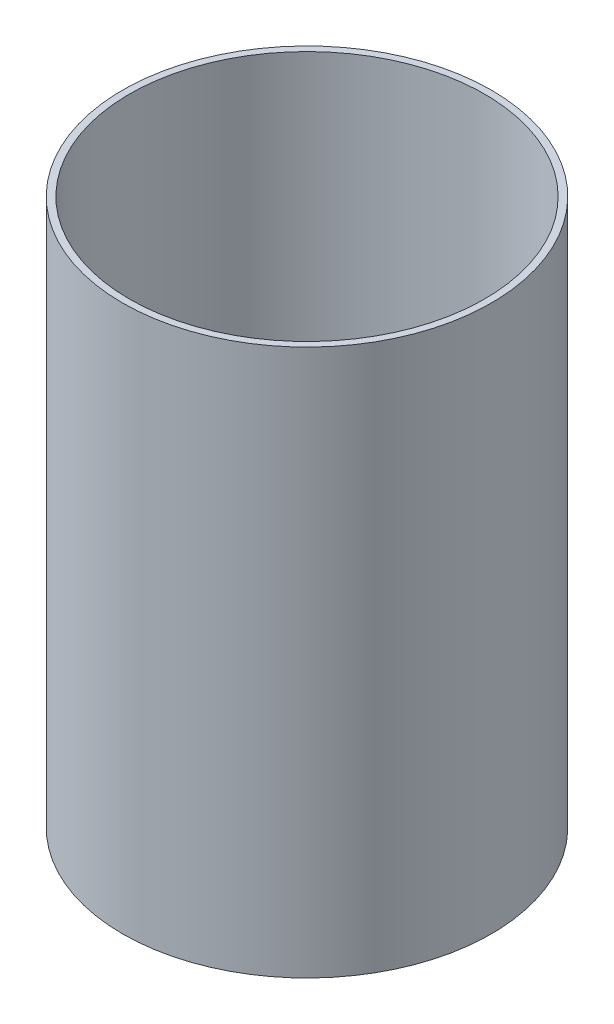
ISO-10303-21;
HEADER;
FILE_DESCRIPTION(('STEP AP214'),'2;1');
FILE_NAME('part.step','',(''),(''),'','','');
FILE_SCHEMA(('AUTOMOTIVE_DESIGN { 1 0 10303 214 1 1 1 1 }'));
ENDSEC;
DATA;
#1=APPLICATION_CONTEXT('core data for automotive mechanical design processes');
#2=APPLICATION_PROTOCOL_DEFINITION('international standard','automotive_design',2000,#1);
#3=PRODUCT_CONTEXT('',#1,'mechanical');
#4=PRODUCT('Part','Part','',(#3));
#5=PRODUCT_RELATED_PRODUCT_CATEGORY('part','',(#4));
#6=PRODUCT_DEFINITION_FORMATION('','',#4);
#7=PRODUCT_DEFINITION_CONTEXT('part definition',#1,'design');
#8=PRODUCT_DEFINITION('design','',#6,#7);
#9=PRODUCT_DEFINITION_SHAPE('','',#8);
#10=(LENGTH_UNIT() NAMED_UNIT(*) SI_UNIT(.MILLI.,.METRE.));
#11=(NAMED_UNIT(*) PLANE_ANGLE_UNIT() SI_UNIT($,.RADIAN.));
#12=(NAMED_UNIT(*) SI_UNIT($,.STERADIAN.) SOLID_ANGLE_UNIT());
#13=UNCERTAINTY_MEASURE_WITH_UNIT(LENGTH_MEASURE(1.E-05),#10,'distance_accuracy_value','');
#14=(GEOMETRIC_REPRESENTATION_CONTEXT(3) GLOBAL_UNCERTAINTY_ASSIGNED_CONTEXT((#13)) GLOBAL_UNIT_ASSIGNED_CONTEXT((#10,
#11,#12)) REPRESENTATION_CONTEXT('',''));
#15=CARTESIAN_POINT('',(0.,0.,0.));
#16=DIRECTION('',(0.,0.,1.));
#17=DIRECTION('',(1.,0.,0.));
#18=AXIS2_PLACEMENT_3D('',#15,#16,#17);
#19=CARTESIAN_POINT('',(0.,203.2,0.));
#20=DIRECTION('',(0.,1.,0.));
#21=DIRECTION('',(0.,0.,1.));
#22=AXIS2_PLACEMENT_3D('',#19,#20,#21);
#23=PLANE('',#22);
#24=CARTESIAN_POINT('',(0.,203.2,0.));
#25=DIRECTION('',(0.,1.,0.));
#26=DIRECTION('',(0.,0.,1.));
#27=AXIS2_PLACEMENT_3D('',#24,#25,#26);
#28=CIRCLE('',#27,68.58);
#29=CARTESIAN_POINT('',(0.,203.2,68.58));
#30=VERTEX_POINT('',#29);
#31=EDGE_CURVE('E10',#30,#30,#28,.T.);
#32=ORIENTED_EDGE('',*,*,#31,.T.);
#33=EDGE_LOOP('',(#32));
#34=FACE_BOUND('',#33,.T.);
#35=CARTESIAN_POINT('',(0.,203.2,0.));
#36=DIRECTION('',(0.,1.,0.));
#37=DIRECTION('',(0.,0.,1.));
#38=AXIS2_PLACEMENT_3D('',#35,#36,#37);
#39=CIRCLE('',#38,66.04);
#40=CARTESIAN_POINT('',(0.,203.2,66.04));
#41=VERTEX_POINT('',#40);
#42=EDGE_CURVE('E47',#41,#41,#39,.T.);
#43=ORIENTED_EDGE('',*,*,#42,.F.);
#44=EDGE_LOOP('',(#43));
#45=FACE_BOUND('',#44,.T.);
#46=ADVANCED_FACE('F35',(#34,#45),#23,.T.);
#47=CARTESIAN_POINT('',(0.,0.,0.));
#48=DIRECTION('',(0.,1.,0.));
#49=DIRECTION('',(0.,0.,1.));
#50=AXIS2_PLACEMENT_3D('',#47,#48,#49);
#51=PLANE('',#50);
#52=CARTESIAN_POINT('',(0.,0.,0.));
#53=DIRECTION('',(0.,1.,0.));
#54=DIRECTION('',(0.,0.,1.));
#55=AXIS2_PLACEMENT_3D('',#52,#53,#54);
#56=CIRCLE('',#55,68.58);
#57=CARTESIAN_POINT('',(0.,0.,68.58));
#58=VERTEX_POINT('',#57);
#59=EDGE_CURVE('E39',#58,#58,#56,.T.);
#60=ORIENTED_EDGE('',*,*,#59,.F.);
#61=EDGE_LOOP('',(#60));
#62=FACE_BOUND('',#61,.T.);
#63=CARTESIAN_POINT('',(0.,0.,0.));
#64=DIRECTION('',(0.,1.,0.));
#65=DIRECTION('',(0.,0.,1.));
#66=AXIS2_PLACEMENT_3D('',#63,#64,#65);
#67=CIRCLE('',#66,66.04);
#68=CARTESIAN_POINT('',(0.,0.,66.04));
#69=VERTEX_POINT('',#68);
#70=EDGE_CURVE('E49',#69,#69,#67,.T.);
#71=ORIENTED_EDGE('',*,*,#70,.T.);
#72=EDGE_LOOP('',(#71));
#73=FACE_BOUND('',#72,.T.);
#74=ADVANCED_FACE('F60',(#62,#73),#51,.F.);
#75=CARTESIAN_POINT('',(0.,203.2,0.));
#76=DIRECTION('',(0.,-1.,0.));
#77=DIRECTION('',(0.,0.,-1.));
#78=AXIS2_PLACEMENT_3D('',#75,#76,#77);
#79=CYLINDRICAL_SURFACE('',#78,68.58);
#80=ORIENTED_EDGE('',*,*,#31,.F.);
#81=EDGE_LOOP('',(#80));
#82=FACE_BOUND('',#81,.T.);
#83=ORIENTED_EDGE('',*,*,#59,.T.);
#84=EDGE_LOOP('',(#83));
#85=FACE_BOUND('',#84,.T.);
#86=ADVANCED_FACE('F37',(#82,#85),#79,.T.);
#87=CARTESIAN_POINT('',(0.,203.2,0.));
#88=DIRECTION('',(0.,-1.,0.));
#89=DIRECTION('',(0.,0.,-1.));
#90=AXIS2_PLACEMENT_3D('',#87,#88,#89);
#91=CYLINDRICAL_SURFACE('',#90,66.04);
#92=ORIENTED_EDGE('',*,*,#42,.T.);
#93=EDGE_LOOP('',(#92));
#94=FACE_BOUND('',#93,.T.);
#95=ORIENTED_EDGE('',*,*,#70,.F.);
#96=EDGE_LOOP('',(#95));
#97=FACE_BOUND('',#96,.T.);
#98=ADVANCED_FACE('F56',(#94,#97),#91,.F.);
#99=CLOSED_SHELL('',(#46,#74,#86,#98));
#100=MANIFOLD_SOLID_BREP('B2',#99);
#101=ADVANCED_BREP_SHAPE_REPRESENTATION('',(#18,#100),#14);
#102=SHAPE_DEFINITION_REPRESENTATION(#9,#101);
ENDSEC;
END-ISO-10303-21;
